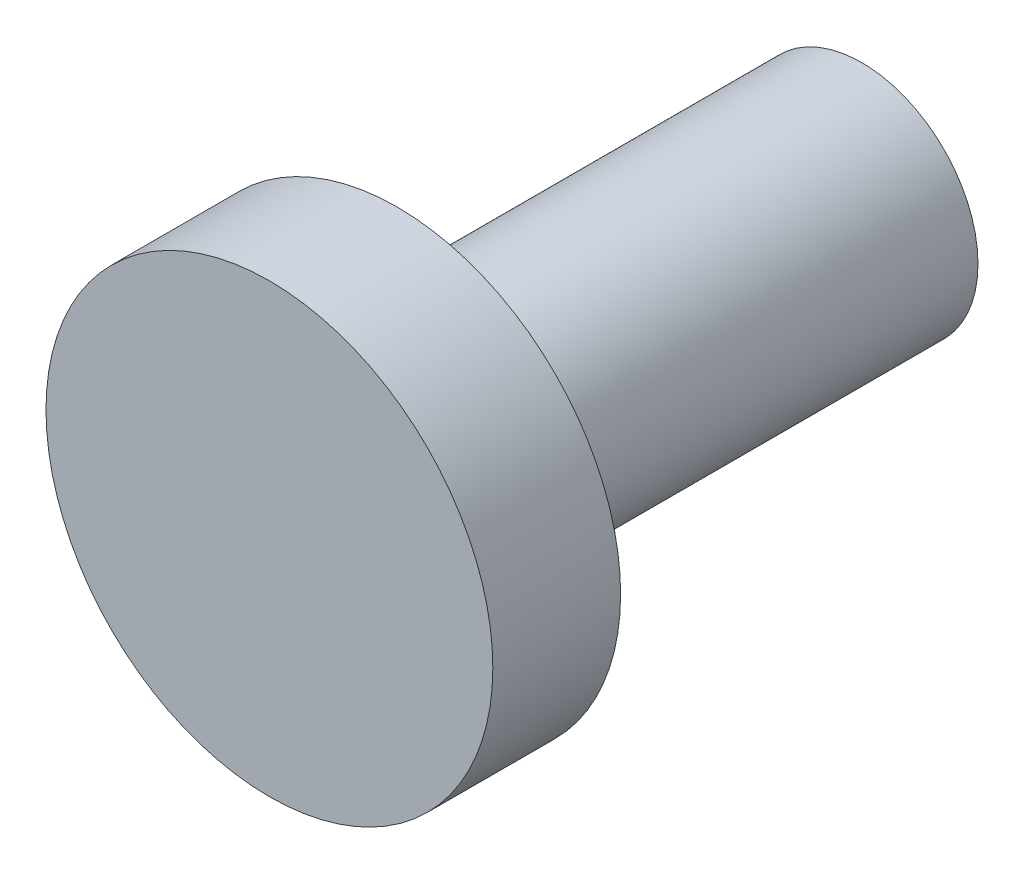
ISO-10303-21;
HEADER;
FILE_DESCRIPTION(('STEP AP214'),'2;1');
FILE_NAME('part.step','',(''),(''),'','','');
FILE_SCHEMA(('AUTOMOTIVE_DESIGN { 1 0 10303 214 1 1 1 1 }'));
ENDSEC;
DATA;
#1=APPLICATION_CONTEXT('core data for automotive mechanical design processes');
#2=APPLICATION_PROTOCOL_DEFINITION('international standard','automotive_design',2000,#1);
#3=PRODUCT_CONTEXT('',#1,'mechanical');
#4=PRODUCT('Part','Part','',(#3));
#5=PRODUCT_RELATED_PRODUCT_CATEGORY('part','',(#4));
#6=PRODUCT_DEFINITION_FORMATION('','',#4);
#7=PRODUCT_DEFINITION_CONTEXT('part definition',#1,'design');
#8=PRODUCT_DEFINITION('design','',#6,#7);
#9=PRODUCT_DEFINITION_SHAPE('','',#8);
#10=(LENGTH_UNIT() NAMED_UNIT(*) SI_UNIT(.MILLI.,.METRE.));
#11=(NAMED_UNIT(*) PLANE_ANGLE_UNIT() SI_UNIT($,.RADIAN.));
#12=(NAMED_UNIT(*) SI_UNIT($,.STERADIAN.) SOLID_ANGLE_UNIT());
#13=UNCERTAINTY_MEASURE_WITH_UNIT(LENGTH_MEASURE(1.E-05),#10,'distance_accuracy_value','');
#14=(GEOMETRIC_REPRESENTATION_CONTEXT(3) GLOBAL_UNCERTAINTY_ASSIGNED_CONTEXT((#13)) GLOBAL_UNIT_ASSIGNED_CONTEXT((#10,
#11,#12)) REPRESENTATION_CONTEXT('',''));
#15=CARTESIAN_POINT('',(0.,0.,0.));
#16=DIRECTION('',(0.,0.,1.));
#17=DIRECTION('',(1.,0.,0.));
#18=AXIS2_PLACEMENT_3D('',#15,#16,#17);
#19=CARTESIAN_POINT('',(33.9083333333333,19.9166666666667,1.65));
#20=DIRECTION('',(0.,0.,-1.));
#21=DIRECTION('',(-1.,0.,0.));
#22=AXIS2_PLACEMENT_3D('',#19,#20,#21);
#23=CYLINDRICAL_SURFACE('',#22,2.885);
#24=CARTESIAN_POINT('',(33.9083333333333,19.9166666666667,1.65));
#25=DIRECTION('',(0.,0.,1.));
#26=DIRECTION('',(1.,0.,0.));
#27=AXIS2_PLACEMENT_3D('',#24,#25,#26);
#28=CIRCLE('',#27,2.885);
#29=CARTESIAN_POINT('',(36.7933333333333,19.9166666666667,1.65));
#30=VERTEX_POINT('',#29);
#31=EDGE_CURVE('E10',#30,#30,#28,.T.);
#32=ORIENTED_EDGE('',*,*,#31,.F.);
#33=EDGE_LOOP('',(#32));
#34=FACE_BOUND('',#33,.T.);
#35=CARTESIAN_POINT('',(33.9083333333333,19.9166666666667,0.));
#36=DIRECTION('',(0.,0.,1.));
#37=DIRECTION('',(1.,0.,0.));
#38=AXIS2_PLACEMENT_3D('',#35,#36,#37);
#39=CIRCLE('',#38,2.885);
#40=CARTESIAN_POINT('',(36.7933333333333,19.9166666666667,0.));
#41=VERTEX_POINT('',#40);
#42=EDGE_CURVE('E34',#41,#41,#39,.T.);
#43=ORIENTED_EDGE('',*,*,#42,.T.);
#44=EDGE_LOOP('',(#43));
#45=FACE_BOUND('',#44,.T.);
#46=ADVANCED_FACE('F31',(#34,#45),#23,.T.);
#47=CARTESIAN_POINT('',(33.9083333333333,19.9166666666667,1.65));
#48=DIRECTION('',(0.,0.,1.));
#49=DIRECTION('',(1.,0.,0.));
#50=AXIS2_PLACEMENT_3D('',#47,#48,#49);
#51=PLANE('',#50);
#52=ORIENTED_EDGE('',*,*,#31,.T.);
#53=EDGE_LOOP('',(#52));
#54=FACE_BOUND('',#53,.T.);
#55=ADVANCED_FACE('F61',(#54),#51,.T.);
#56=CARTESIAN_POINT('',(33.9083333333333,19.9166666666667,0.));
#57=DIRECTION('',(0.,0.,1.));
#58=DIRECTION('',(1.,0.,0.));
#59=AXIS2_PLACEMENT_3D('',#56,#57,#58);
#60=PLANE('',#59);
#61=CARTESIAN_POINT('',(33.9083333333333,19.9166666666667,0.));
#62=DIRECTION('',(0.,0.,1.));
#63=DIRECTION('',(1.,0.,0.));
#64=AXIS2_PLACEMENT_3D('',#61,#62,#63);
#65=CIRCLE('',#64,1.5);
#66=CARTESIAN_POINT('',(35.4083333333333,19.9166666666667,0.));
#67=VERTEX_POINT('',#66);
#68=EDGE_CURVE('E43',#67,#67,#65,.T.);
#69=ORIENTED_EDGE('',*,*,#68,.T.);
#70=EDGE_LOOP('',(#69));
#71=FACE_BOUND('',#70,.T.);
#72=ORIENTED_EDGE('',*,*,#42,.F.);
#73=EDGE_LOOP('',(#72));
#74=FACE_BOUND('',#73,.T.);
#75=ADVANCED_FACE('F58',(#71,#74),#60,.F.);
#76=CARTESIAN_POINT('',(33.9083333333333,19.9166666666667,-6.));
#77=DIRECTION('',(0.,0.,1.));
#78=DIRECTION('',(1.,0.,0.));
#79=AXIS2_PLACEMENT_3D('',#76,#77,#78);
#80=CYLINDRICAL_SURFACE('',#79,1.5);
#81=CARTESIAN_POINT('',(33.9083333333333,19.9166666666667,-6.));
#82=DIRECTION('',(0.,0.,1.));
#83=DIRECTION('',(1.,0.,0.));
#84=AXIS2_PLACEMENT_3D('',#81,#82,#83);
#85=CIRCLE('',#84,1.5);
#86=CARTESIAN_POINT('',(35.4083333333333,19.9166666666667,-6.));
#87=VERTEX_POINT('',#86);
#88=EDGE_CURVE('E41',#87,#87,#85,.T.);
#89=ORIENTED_EDGE('',*,*,#88,.T.);
#90=EDGE_LOOP('',(#89));
#91=FACE_BOUND('',#90,.T.);
#92=ORIENTED_EDGE('',*,*,#68,.F.);
#93=EDGE_LOOP('',(#92));
#94=FACE_BOUND('',#93,.T.);
#95=ADVANCED_FACE('F49',(#91,#94),#80,.T.);
#96=CARTESIAN_POINT('',(33.9083333333333,19.9166666666667,-6.));
#97=DIRECTION('',(0.,0.,1.));
#98=DIRECTION('',(1.,0.,0.));
#99=AXIS2_PLACEMENT_3D('',#96,#97,#98);
#100=PLANE('',#99);
#101=ORIENTED_EDGE('',*,*,#88,.F.);
#102=EDGE_LOOP('',(#101));
#103=FACE_BOUND('',#102,.T.);
#104=ADVANCED_FACE('F52',(#103),#100,.F.);
#105=CLOSED_SHELL('',(#46,#55,#75,#95,#104));
#106=MANIFOLD_SOLID_BREP('B2',#105);
#107=ADVANCED_BREP_SHAPE_REPRESENTATION('',(#18,#106),#14);
#108=SHAPE_DEFINITION_REPRESENTATION(#9,#107);
ENDSEC;
END-ISO-10303-21;
